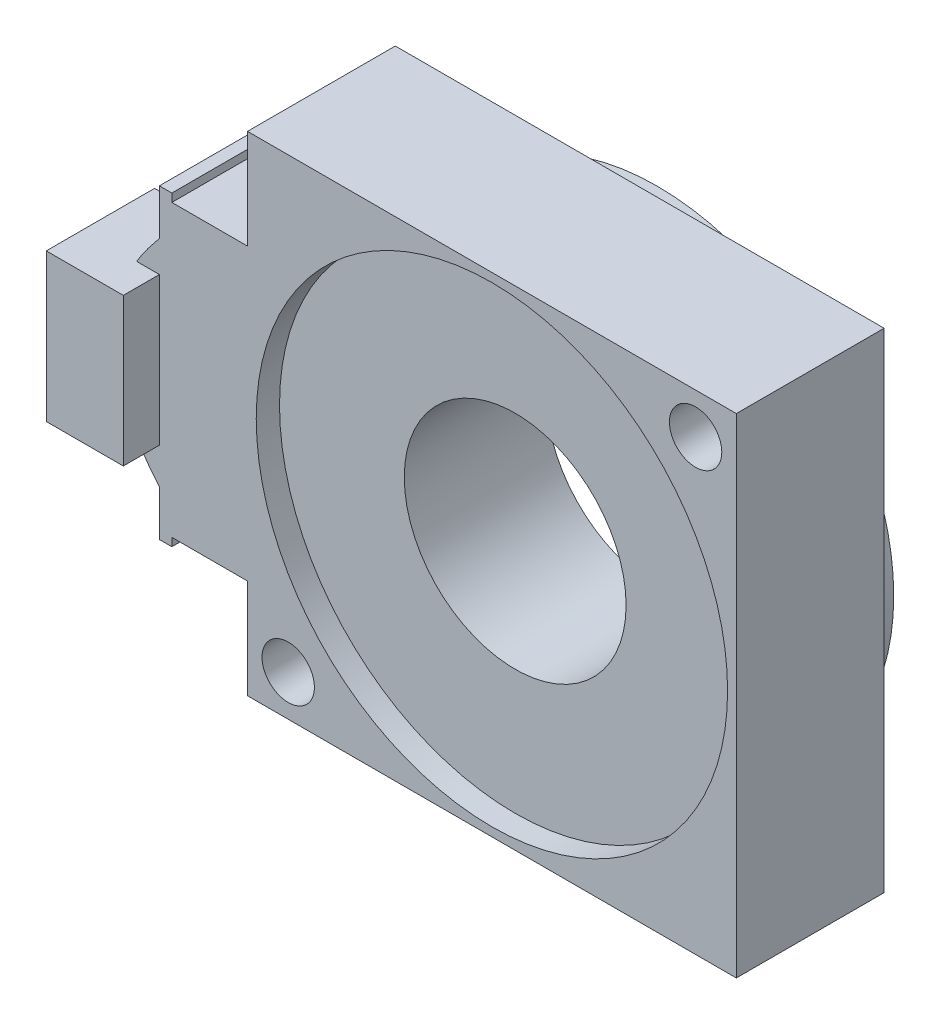
ISO-10303-21;
HEADER;
FILE_DESCRIPTION(('STEP AP214'),'2;1');
FILE_NAME('part.step','',(''),(''),'','','');
FILE_SCHEMA(('AUTOMOTIVE_DESIGN { 1 0 10303 214 1 1 1 1 }'));
ENDSEC;
DATA;
#1=APPLICATION_CONTEXT('core data for automotive mechanical design processes');
#2=APPLICATION_PROTOCOL_DEFINITION('international standard','automotive_design',2000,#1);
#3=PRODUCT_CONTEXT('',#1,'mechanical');
#4=PRODUCT('Part','Part','',(#3));
#5=PRODUCT_RELATED_PRODUCT_CATEGORY('part','',(#4));
#6=PRODUCT_DEFINITION_FORMATION('','',#4);
#7=PRODUCT_DEFINITION_CONTEXT('part definition',#1,'design');
#8=PRODUCT_DEFINITION('design','',#6,#7);
#9=PRODUCT_DEFINITION_SHAPE('','',#8);
#10=(LENGTH_UNIT() NAMED_UNIT(*) SI_UNIT(.MILLI.,.METRE.));
#11=(NAMED_UNIT(*) PLANE_ANGLE_UNIT() SI_UNIT($,.RADIAN.));
#12=(NAMED_UNIT(*) SI_UNIT($,.STERADIAN.) SOLID_ANGLE_UNIT());
#13=UNCERTAINTY_MEASURE_WITH_UNIT(LENGTH_MEASURE(1.E-05),#10,'distance_accuracy_value','');
#14=(GEOMETRIC_REPRESENTATION_CONTEXT(3) GLOBAL_UNCERTAINTY_ASSIGNED_CONTEXT((#13)) GLOBAL_UNIT_ASSIGNED_CONTEXT((#10,
#11,#12)) REPRESENTATION_CONTEXT('',''));
#15=CARTESIAN_POINT('',(0.,0.,0.));
#16=DIRECTION('',(0.,0.,1.));
#17=DIRECTION('',(1.,0.,0.));
#18=AXIS2_PLACEMENT_3D('',#15,#16,#17);
#19=CARTESIAN_POINT('',(0.,0.,12.7));
#20=DIRECTION('',(0.,0.,1.));
#21=DIRECTION('',(1.,0.,0.));
#22=AXIS2_PLACEMENT_3D('',#19,#20,#21);
#23=PLANE('',#22);
#24=CARTESIAN_POINT('',(0.,0.,12.7));
#25=DIRECTION('',(0.,0.,1.));
#26=DIRECTION('',(1.,0.,0.));
#27=AXIS2_PLACEMENT_3D('',#24,#25,#26);
#28=CIRCLE('',#27,20.25);
#29=CARTESIAN_POINT('',(20.25,0.,12.7));
#30=VERTEX_POINT('',#29);
#31=EDGE_CURVE('E226',#30,#30,#28,.T.);
#32=ORIENTED_EDGE('',*,*,#31,.F.);
#33=EDGE_LOOP('',(#32));
#34=FACE_BOUND('',#33,.T.);
#35=CARTESIAN_POINT('',(17.5008928343671,17.5008928343671,12.7));
#36=DIRECTION('',(0.,0.,1.));
#37=DIRECTION('',(1.,0.,0.));
#38=AXIS2_PLACEMENT_3D('',#35,#36,#37);
#39=CIRCLE('',#38,2.25);
#40=CARTESIAN_POINT('',(19.7508928343671,17.5008928343671,12.7));
#41=VERTEX_POINT('',#40);
#42=EDGE_CURVE('E412',#41,#41,#39,.T.);
#43=ORIENTED_EDGE('',*,*,#42,.F.);
#44=EDGE_LOOP('',(#43));
#45=FACE_BOUND('',#44,.T.);
#46=CARTESIAN_POINT('',(-17.5008928343671,-17.5008928343671,12.7));
#47=DIRECTION('',(0.,0.,1.));
#48=DIRECTION('',(-1.,0.,0.));
#49=AXIS2_PLACEMENT_3D('',#46,#47,#48);
#50=CIRCLE('',#49,2.25);
#51=CARTESIAN_POINT('',(-19.7508928343671,-17.5008928343671,12.7));
#52=VERTEX_POINT('',#51);
#53=EDGE_CURVE('E419',#52,#52,#50,.T.);
#54=ORIENTED_EDGE('',*,*,#53,.F.);
#55=EDGE_LOOP('',(#54));
#56=FACE_BOUND('',#55,.T.);
#57=CARTESIAN_POINT('',(-28.57,9.24089283436704,12.7));
#58=CARTESIAN_POINT('',(-36.45,0.,12.7));
#59=CARTESIAN_POINT('',(-28.57,-9.24089283436705,12.7));
#60=B_SPLINE_CURVE_WITH_KNOTS('',2,(#57,#58,#59),.UNSPECIFIED.,.F.,.F.,(3,3),(0.,1.),.UNSPECIFIED.);
#61=CARTESIAN_POINT('',(-28.57,9.24089283436704,12.7));
#62=VERTEX_POINT('',#61);
#63=CARTESIAN_POINT('',(-30.5239314132723,6.56089283436704,12.7));
#64=VERTEX_POINT('',#63);
#65=EDGE_CURVE('E362',#62,#64,#60,.T.);
#66=ORIENTED_EDGE('',*,*,#65,.T.);
#67=DIRECTION('',(1.,0.,0.));
#68=VECTOR('',#67,1.);
#69=CARTESIAN_POINT('',(0.,6.56089283436705,12.7));
#70=LINE('',#69,#68);
#71=CARTESIAN_POINT('',(-28.57,6.56089283436704,12.7));
#72=VERTEX_POINT('',#71);
#73=EDGE_CURVE('E216',#64,#72,#70,.T.);
#74=ORIENTED_EDGE('',*,*,#73,.T.);
#75=DIRECTION('',(0.,-1.,0.));
#76=VECTOR('',#75,1.);
#77=CARTESIAN_POINT('',(-28.57,0.,12.7));
#78=LINE('',#77,#76);
#79=CARTESIAN_POINT('',(-28.57,-6.13910716563296,12.7));
#80=VERTEX_POINT('',#79);
#81=EDGE_CURVE('E11',#72,#80,#78,.T.);
#82=ORIENTED_EDGE('',*,*,#81,.T.);
#83=DIRECTION('',(-1.,0.,0.));
#84=VECTOR('',#83,1.);
#85=CARTESIAN_POINT('',(0.,-6.13910716563296,12.7));
#86=LINE('',#85,#84);
#87=CARTESIAN_POINT('',(-30.7710832797259,-6.13910716563296,12.7));
#88=VERTEX_POINT('',#87);
#89=EDGE_CURVE('E213',#80,#88,#86,.T.);
#90=ORIENTED_EDGE('',*,*,#89,.T.);
#91=CARTESIAN_POINT('',(-28.57,-9.24089283436705,12.7));
#92=VERTEX_POINT('',#91);
#93=EDGE_CURVE('E369',#88,#92,#60,.T.);
#94=ORIENTED_EDGE('',*,*,#93,.T.);
#95=DIRECTION('',(0.,-1.,0.));
#96=VECTOR('',#95,1.);
#97=CARTESIAN_POINT('',(-28.57,-13.1608928343671,12.7));
#98=LINE('',#97,#96);
#99=CARTESIAN_POINT('',(-28.57,-13.1608928343671,12.7));
#100=VERTEX_POINT('',#99);
#101=EDGE_CURVE('E368',#92,#100,#98,.T.);
#102=ORIENTED_EDGE('',*,*,#101,.T.);
#103=DIRECTION('',(1.,0.,0.));
#104=VECTOR('',#103,1.);
#105=CARTESIAN_POINT('',(-27.5,-13.1608928343671,12.7));
#106=LINE('',#105,#104);
#107=CARTESIAN_POINT('',(-27.5,-13.1608928343671,12.7));
#108=VERTEX_POINT('',#107);
#109=EDGE_CURVE('E372',#100,#108,#106,.T.);
#110=ORIENTED_EDGE('',*,*,#109,.T.);
#111=DIRECTION('',(0.,1.,0.));
#112=VECTOR('',#111,1.);
#113=CARTESIAN_POINT('',(-27.5,-12.4608928343671,12.7));
#114=LINE('',#113,#112);
#115=CARTESIAN_POINT('',(-27.5,-12.4608928343671,12.7));
#116=VERTEX_POINT('',#115);
#117=EDGE_CURVE('E384',#108,#116,#114,.T.);
#118=ORIENTED_EDGE('',*,*,#117,.T.);
#119=DIRECTION('',(1.,0.,0.));
#120=VECTOR('',#119,1.);
#121=CARTESIAN_POINT('',(-21.,-12.4608928343671,12.7));
#122=LINE('',#121,#120);
#123=CARTESIAN_POINT('',(-21.,-12.4608928343671,12.7));
#124=VERTEX_POINT('',#123);
#125=EDGE_CURVE('E241',#116,#124,#122,.T.);
#126=ORIENTED_EDGE('',*,*,#125,.T.);
#127=DIRECTION('',(0.,-1.,0.));
#128=VECTOR('',#127,1.);
#129=CARTESIAN_POINT('',(-21.,21.,12.7));
#130=LINE('',#129,#128);
#131=CARTESIAN_POINT('',(-21.,-21.,12.7));
#132=VERTEX_POINT('',#131);
#133=EDGE_CURVE('E426',#124,#132,#130,.T.);
#134=ORIENTED_EDGE('',*,*,#133,.T.);
#135=DIRECTION('',(1.,0.,0.));
#136=VECTOR('',#135,1.);
#137=CARTESIAN_POINT('',(21.,-21.,12.7));
#138=LINE('',#137,#136);
#139=CARTESIAN_POINT('',(21.,-21.,12.7));
#140=VERTEX_POINT('',#139);
#141=EDGE_CURVE('E430',#132,#140,#138,.T.);
#142=ORIENTED_EDGE('',*,*,#141,.T.);
#143=DIRECTION('',(0.,1.,0.));
#144=VECTOR('',#143,1.);
#145=CARTESIAN_POINT('',(21.,21.,12.7));
#146=LINE('',#145,#144);
#147=CARTESIAN_POINT('',(21.,21.,12.7));
#148=VERTEX_POINT('',#147);
#149=EDGE_CURVE('E335',#140,#148,#146,.T.);
#150=ORIENTED_EDGE('',*,*,#149,.T.);
#151=DIRECTION('',(-1.,0.,0.));
#152=VECTOR('',#151,1.);
#153=CARTESIAN_POINT('',(0.,21.,12.7));
#154=LINE('',#153,#152);
#155=CARTESIAN_POINT('',(-21.,21.,12.7));
#156=VERTEX_POINT('',#155);
#157=EDGE_CURVE('E342',#148,#156,#154,.T.);
#158=ORIENTED_EDGE('',*,*,#157,.T.);
#159=CARTESIAN_POINT('',(-21.,12.4608928343671,12.7));
#160=VERTEX_POINT('',#159);
#161=EDGE_CURVE('E427',#156,#160,#130,.T.);
#162=ORIENTED_EDGE('',*,*,#161,.T.);
#163=DIRECTION('',(-1.,0.,0.));
#164=VECTOR('',#163,1.);
#165=CARTESIAN_POINT('',(-21.,12.460892834367,12.7));
#166=LINE('',#165,#164);
#167=CARTESIAN_POINT('',(-27.5,12.460892834367,12.7));
#168=VERTEX_POINT('',#167);
#169=EDGE_CURVE('E63',#160,#168,#166,.T.);
#170=ORIENTED_EDGE('',*,*,#169,.T.);
#171=DIRECTION('',(0.,1.,0.));
#172=VECTOR('',#171,1.);
#173=CARTESIAN_POINT('',(-27.5,12.460892834367,12.7));
#174=LINE('',#173,#172);
#175=CARTESIAN_POINT('',(-27.5,13.160892834367,12.7));
#176=VERTEX_POINT('',#175);
#177=EDGE_CURVE('E448',#168,#176,#174,.T.);
#178=ORIENTED_EDGE('',*,*,#177,.T.);
#179=DIRECTION('',(-1.,0.,0.));
#180=VECTOR('',#179,1.);
#181=CARTESIAN_POINT('',(-27.5,13.160892834367,12.7));
#182=LINE('',#181,#180);
#183=CARTESIAN_POINT('',(-28.57,13.160892834367,12.7));
#184=VERTEX_POINT('',#183);
#185=EDGE_CURVE('E450',#176,#184,#182,.T.);
#186=ORIENTED_EDGE('',*,*,#185,.T.);
#187=DIRECTION('',(0.,-1.,0.));
#188=VECTOR('',#187,1.);
#189=CARTESIAN_POINT('',(-28.57,13.160892834367,12.7));
#190=LINE('',#189,#188);
#191=EDGE_CURVE('E367',#184,#62,#190,.T.);
#192=ORIENTED_EDGE('',*,*,#191,.T.);
#193=EDGE_LOOP('',(#66,#74,#82,#90,#94,#102,#110,#118,#126,#134,#142,#150,#158,#162,#170,#178,
#186,#192));
#194=FACE_BOUND('',#193,.T.);
#195=ADVANCED_FACE('F40',(#34,#45,#56,#194),#23,.T.);
#196=CARTESIAN_POINT('',(-28.57,9.24089283436704,0.));
#197=CARTESIAN_POINT('',(-36.45,0.,0.));
#198=CARTESIAN_POINT('',(-28.57,-9.24089283436705,0.));
#199=B_SPLINE_CURVE_WITH_KNOTS('',2,(#196,#197,#198),.UNSPECIFIED.,.F.,.F.,(3,3),(0.,1.),.UNSPECIFIED.);
#200=DIRECTION('',(0.,0.,1.));
#201=VECTOR('',#200,1.);
#202=SURFACE_OF_LINEAR_EXTRUSION('',#199,#201);
#203=CARTESIAN_POINT('',(-28.57,9.24089283436704,6.5));
#204=CARTESIAN_POINT('',(-36.45,0.,6.5));
#205=CARTESIAN_POINT('',(-28.57,-9.24089283436705,6.5));
#206=B_SPLINE_CURVE_WITH_KNOTS('',2,(#203,#204,#205),.UNSPECIFIED.,.F.,.F.,(3,3),(0.,1.),.UNSPECIFIED.);
#207=CARTESIAN_POINT('',(-30.7710832797259,-6.13910716563296,6.5));
#208=VERTEX_POINT('',#207);
#209=CARTESIAN_POINT('',(-30.5239314132723,6.56089283436704,6.5));
#210=VERTEX_POINT('',#209);
#211=EDGE_CURVE('E230',#208,#210,#206,.F.);
#212=ORIENTED_EDGE('',*,*,#211,.T.);
#213=DIRECTION('',(0.,0.,1.));
#214=VECTOR('',#213,1.);
#215=CARTESIAN_POINT('',(-30.5239314132723,6.56089283436704,0.));
#216=LINE('',#215,#214);
#217=EDGE_CURVE('E48',#210,#64,#216,.T.);
#218=ORIENTED_EDGE('',*,*,#217,.T.);
#219=ORIENTED_EDGE('',*,*,#65,.F.);
#220=DIRECTION('',(0.,0.,1.));
#221=VECTOR('',#220,1.);
#222=CARTESIAN_POINT('',(-28.57,9.24089283436704,0.));
#223=LINE('',#222,#221);
#224=CARTESIAN_POINT('',(-28.57,9.24089283436704,0.));
#225=VERTEX_POINT('',#224);
#226=EDGE_CURVE('E401',#225,#62,#223,.T.);
#227=ORIENTED_EDGE('',*,*,#226,.F.);
#228=CARTESIAN_POINT('',(-28.57,-9.24089283436705,0.));
#229=VERTEX_POINT('',#228);
#230=EDGE_CURVE('E250',#225,#229,#199,.T.);
#231=ORIENTED_EDGE('',*,*,#230,.T.);
#232=DIRECTION('',(0.,0.,1.));
#233=VECTOR('',#232,1.);
#234=CARTESIAN_POINT('',(-28.57,-9.24089283436705,0.));
#235=LINE('',#234,#233);
#236=EDGE_CURVE('E398',#229,#92,#235,.T.);
#237=ORIENTED_EDGE('',*,*,#236,.T.);
#238=ORIENTED_EDGE('',*,*,#93,.F.);
#239=DIRECTION('',(0.,0.,1.));
#240=VECTOR('',#239,1.);
#241=CARTESIAN_POINT('',(-30.7710832797259,-6.13910716563296,0.));
#242=LINE('',#241,#240);
#243=EDGE_CURVE('E355',#88,#208,#242,.F.);
#244=ORIENTED_EDGE('',*,*,#243,.T.);
#245=EDGE_LOOP('',(#212,#218,#219,#227,#231,#237,#238,#244));
#246=FACE_BOUND('',#245,.T.);
#247=ADVANCED_FACE('F262',(#246),#202,.T.);
#248=CARTESIAN_POINT('',(-21.,21.,12.7));
#249=DIRECTION('',(1.,0.,0.));
#250=DIRECTION('',(0.,0.,-1.));
#251=AXIS2_PLACEMENT_3D('',#248,#249,#250);
#252=PLANE('',#251);
#253=DIRECTION('',(0.,0.,1.));
#254=VECTOR('',#253,1.);
#255=CARTESIAN_POINT('',(-21.,-12.4608928343671,0.));
#256=LINE('',#255,#254);
#257=CARTESIAN_POINT('',(-21.,-12.4608928343671,0.));
#258=VERTEX_POINT('',#257);
#259=EDGE_CURVE('E389',#258,#124,#256,.T.);
#260=ORIENTED_EDGE('',*,*,#259,.F.);
#261=DIRECTION('',(0.,-1.,0.));
#262=VECTOR('',#261,1.);
#263=CARTESIAN_POINT('',(-21.,21.,0.));
#264=LINE('',#263,#262);
#265=CARTESIAN_POINT('',(-21.,-21.,0.));
#266=VERTEX_POINT('',#265);
#267=EDGE_CURVE('E415',#258,#266,#264,.T.);
#268=ORIENTED_EDGE('',*,*,#267,.T.);
#269=DIRECTION('',(0.,0.,-1.));
#270=VECTOR('',#269,1.);
#271=CARTESIAN_POINT('',(-21.,-21.,12.7));
#272=LINE('',#271,#270);
#273=EDGE_CURVE('E325',#132,#266,#272,.T.);
#274=ORIENTED_EDGE('',*,*,#273,.F.);
#275=ORIENTED_EDGE('',*,*,#133,.F.);
#276=EDGE_LOOP('',(#260,#268,#274,#275));
#277=FACE_BOUND('',#276,.T.);
#278=ADVANCED_FACE('F266',(#277),#252,.F.);
#279=CARTESIAN_POINT('',(-21.,21.,0.));
#280=VERTEX_POINT('',#279);
#281=CARTESIAN_POINT('',(-21.,12.460892834367,0.));
#282=VERTEX_POINT('',#281);
#283=EDGE_CURVE('E330',#280,#282,#264,.T.);
#284=ORIENTED_EDGE('',*,*,#283,.T.);
#285=DIRECTION('',(0.,0.,1.));
#286=VECTOR('',#285,1.);
#287=CARTESIAN_POINT('',(-21.,12.460892834367,0.));
#288=LINE('',#287,#286);
#289=EDGE_CURVE('E409',#282,#160,#288,.T.);
#290=ORIENTED_EDGE('',*,*,#289,.T.);
#291=ORIENTED_EDGE('',*,*,#161,.F.);
#292=DIRECTION('',(0.,0.,-1.));
#293=VECTOR('',#292,1.);
#294=CARTESIAN_POINT('',(-21.,21.,12.7));
#295=LINE('',#294,#293);
#296=EDGE_CURVE('E231',#156,#280,#295,.T.);
#297=ORIENTED_EDGE('',*,*,#296,.T.);
#298=EDGE_LOOP('',(#284,#290,#291,#297));
#299=FACE_BOUND('',#298,.T.);
#300=ADVANCED_FACE('F42',(#299),#252,.F.);
#301=CARTESIAN_POINT('',(21.,-21.,12.7));
#302=DIRECTION('',(0.,1.,0.));
#303=DIRECTION('',(0.,0.,1.));
#304=AXIS2_PLACEMENT_3D('',#301,#302,#303);
#305=PLANE('',#304);
#306=DIRECTION('',(1.,0.,0.));
#307=VECTOR('',#306,1.);
#308=CARTESIAN_POINT('',(21.,-21.,0.));
#309=LINE('',#308,#307);
#310=CARTESIAN_POINT('',(21.,-21.,0.));
#311=VERTEX_POINT('',#310);
#312=EDGE_CURVE('E319',#266,#311,#309,.T.);
#313=ORIENTED_EDGE('',*,*,#312,.T.);
#314=DIRECTION('',(0.,0.,-1.));
#315=VECTOR('',#314,1.);
#316=CARTESIAN_POINT('',(21.,-21.,12.7));
#317=LINE('',#316,#315);
#318=EDGE_CURVE('E322',#140,#311,#317,.T.);
#319=ORIENTED_EDGE('',*,*,#318,.F.);
#320=ORIENTED_EDGE('',*,*,#141,.F.);
#321=ORIENTED_EDGE('',*,*,#273,.T.);
#322=EDGE_LOOP('',(#313,#319,#320,#321));
#323=FACE_BOUND('',#322,.T.);
#324=ADVANCED_FACE('F308',(#323),#305,.F.);
#325=CARTESIAN_POINT('',(21.,21.,12.7));
#326=DIRECTION('',(-1.,0.,0.));
#327=DIRECTION('',(0.,0.,1.));
#328=AXIS2_PLACEMENT_3D('',#325,#326,#327);
#329=PLANE('',#328);
#330=DIRECTION('',(0.,1.,0.));
#331=VECTOR('',#330,1.);
#332=CARTESIAN_POINT('',(21.,21.,0.));
#333=LINE('',#332,#331);
#334=CARTESIAN_POINT('',(21.,21.,0.));
#335=VERTEX_POINT('',#334);
#336=EDGE_CURVE('E329',#311,#335,#333,.T.);
#337=ORIENTED_EDGE('',*,*,#336,.T.);
#338=DIRECTION('',(0.,0.,-1.));
#339=VECTOR('',#338,1.);
#340=CARTESIAN_POINT('',(21.,21.,12.7));
#341=LINE('',#340,#339);
#342=EDGE_CURVE('E336',#148,#335,#341,.T.);
#343=ORIENTED_EDGE('',*,*,#342,.F.);
#344=ORIENTED_EDGE('',*,*,#149,.F.);
#345=ORIENTED_EDGE('',*,*,#318,.T.);
#346=EDGE_LOOP('',(#337,#343,#344,#345));
#347=FACE_BOUND('',#346,.T.);
#348=ADVANCED_FACE('F305',(#347),#329,.F.);
#349=CARTESIAN_POINT('',(0.,21.,12.7));
#350=DIRECTION('',(0.,-1.,0.));
#351=DIRECTION('',(0.,0.,-1.));
#352=AXIS2_PLACEMENT_3D('',#349,#350,#351);
#353=PLANE('',#352);
#354=DIRECTION('',(-1.,0.,0.));
#355=VECTOR('',#354,1.);
#356=CARTESIAN_POINT('',(0.,21.,0.));
#357=LINE('',#356,#355);
#358=EDGE_CURVE('E340',#335,#280,#357,.T.);
#359=ORIENTED_EDGE('',*,*,#358,.T.);
#360=ORIENTED_EDGE('',*,*,#296,.F.);
#361=ORIENTED_EDGE('',*,*,#157,.F.);
#362=ORIENTED_EDGE('',*,*,#342,.T.);
#363=EDGE_LOOP('',(#359,#360,#361,#362));
#364=FACE_BOUND('',#363,.T.);
#365=ADVANCED_FACE('F301',(#364),#353,.F.);
#366=CARTESIAN_POINT('',(0.,0.,0.));
#367=DIRECTION('',(0.,0.,1.));
#368=DIRECTION('',(1.,0.,0.));
#369=AXIS2_PLACEMENT_3D('',#366,#367,#368);
#370=PLANE('',#369);
#371=CARTESIAN_POINT('',(0.,0.,0.));
#372=DIRECTION('',(0.,0.,-1.));
#373=DIRECTION('',(-1.,0.,0.));
#374=AXIS2_PLACEMENT_3D('',#371,#372,#373);
#375=CIRCLE('',#374,20.325);
#376=CARTESIAN_POINT('',(-20.325,0.,0.));
#377=VERTEX_POINT('',#376);
#378=EDGE_CURVE('E227',#377,#377,#375,.T.);
#379=ORIENTED_EDGE('',*,*,#378,.F.);
#380=EDGE_LOOP('',(#379));
#381=FACE_BOUND('',#380,.T.);
#382=CARTESIAN_POINT('',(17.5008928343671,17.5008928343671,0.));
#383=DIRECTION('',(0.,0.,1.));
#384=DIRECTION('',(1.,0.,0.));
#385=AXIS2_PLACEMENT_3D('',#382,#383,#384);
#386=CIRCLE('',#385,2.25);
#387=CARTESIAN_POINT('',(19.7508928343671,17.5008928343671,0.));
#388=VERTEX_POINT('',#387);
#389=EDGE_CURVE('E416',#388,#388,#386,.T.);
#390=ORIENTED_EDGE('',*,*,#389,.T.);
#391=EDGE_LOOP('',(#390));
#392=FACE_BOUND('',#391,.T.);
#393=CARTESIAN_POINT('',(-17.5008928343671,-17.5008928343671,0.));
#394=DIRECTION('',(0.,0.,1.));
#395=DIRECTION('',(-1.,0.,0.));
#396=AXIS2_PLACEMENT_3D('',#393,#394,#395);
#397=CIRCLE('',#396,2.25);
#398=CARTESIAN_POINT('',(-19.7508928343671,-17.5008928343671,0.));
#399=VERTEX_POINT('',#398);
#400=EDGE_CURVE('E391',#399,#399,#397,.T.);
#401=ORIENTED_EDGE('',*,*,#400,.T.);
#402=EDGE_LOOP('',(#401));
#403=FACE_BOUND('',#402,.T.);
#404=ORIENTED_EDGE('',*,*,#283,.F.);
#405=ORIENTED_EDGE('',*,*,#358,.F.);
#406=ORIENTED_EDGE('',*,*,#336,.F.);
#407=ORIENTED_EDGE('',*,*,#312,.F.);
#408=ORIENTED_EDGE('',*,*,#267,.F.);
#409=DIRECTION('',(1.,0.,0.));
#410=VECTOR('',#409,1.);
#411=CARTESIAN_POINT('',(-21.,-12.4608928343671,0.));
#412=LINE('',#411,#410);
#413=CARTESIAN_POINT('',(-27.5,-12.4608928343671,0.));
#414=VERTEX_POINT('',#413);
#415=EDGE_CURVE('E411',#414,#258,#412,.T.);
#416=ORIENTED_EDGE('',*,*,#415,.F.);
#417=DIRECTION('',(0.,1.,0.));
#418=VECTOR('',#417,1.);
#419=CARTESIAN_POINT('',(-27.5,-12.4608928343671,0.));
#420=LINE('',#419,#418);
#421=CARTESIAN_POINT('',(-27.5,-13.1608928343671,0.));
#422=VERTEX_POINT('',#421);
#423=EDGE_CURVE('E440',#422,#414,#420,.T.);
#424=ORIENTED_EDGE('',*,*,#423,.F.);
#425=DIRECTION('',(1.,0.,0.));
#426=VECTOR('',#425,1.);
#427=CARTESIAN_POINT('',(-27.5,-13.1608928343671,0.));
#428=LINE('',#427,#426);
#429=CARTESIAN_POINT('',(-28.57,-13.1608928343671,0.));
#430=VERTEX_POINT('',#429);
#431=EDGE_CURVE('E444',#430,#422,#428,.T.);
#432=ORIENTED_EDGE('',*,*,#431,.F.);
#433=DIRECTION('',(0.,-1.,0.));
#434=VECTOR('',#433,1.);
#435=CARTESIAN_POINT('',(-28.57,-13.1608928343671,0.));
#436=LINE('',#435,#434);
#437=EDGE_CURVE('E256',#229,#430,#436,.T.);
#438=ORIENTED_EDGE('',*,*,#437,.F.);
#439=ORIENTED_EDGE('',*,*,#230,.F.);
#440=DIRECTION('',(0.,-1.,0.));
#441=VECTOR('',#440,1.);
#442=CARTESIAN_POINT('',(-28.57,13.160892834367,0.));
#443=LINE('',#442,#441);
#444=CARTESIAN_POINT('',(-28.57,13.160892834367,0.));
#445=VERTEX_POINT('',#444);
#446=EDGE_CURVE('E247',#445,#225,#443,.T.);
#447=ORIENTED_EDGE('',*,*,#446,.F.);
#448=DIRECTION('',(-1.,0.,0.));
#449=VECTOR('',#448,1.);
#450=CARTESIAN_POINT('',(-27.5,13.160892834367,0.));
#451=LINE('',#450,#449);
#452=CARTESIAN_POINT('',(-27.5,13.160892834367,0.));
#453=VERTEX_POINT('',#452);
#454=EDGE_CURVE('E244',#453,#445,#451,.T.);
#455=ORIENTED_EDGE('',*,*,#454,.F.);
#456=DIRECTION('',(0.,1.,0.));
#457=VECTOR('',#456,1.);
#458=CARTESIAN_POINT('',(-27.5,12.460892834367,0.));
#459=LINE('',#458,#457);
#460=CARTESIAN_POINT('',(-27.5,12.460892834367,0.));
#461=VERTEX_POINT('',#460);
#462=EDGE_CURVE('E240',#461,#453,#459,.T.);
#463=ORIENTED_EDGE('',*,*,#462,.F.);
#464=DIRECTION('',(-1.,0.,0.));
#465=VECTOR('',#464,1.);
#466=CARTESIAN_POINT('',(-21.,12.460892834367,0.));
#467=LINE('',#466,#465);
#468=EDGE_CURVE('E237',#282,#461,#467,.T.);
#469=ORIENTED_EDGE('',*,*,#468,.F.);
#470=EDGE_LOOP('',(#404,#405,#406,#407,#408,#416,#424,#432,#438,#439,#447,#455,#463,#469));
#471=FACE_BOUND('',#470,.T.);
#472=ADVANCED_FACE('F294',(#381,#392,#403,#471),#370,.F.);
#473=CARTESIAN_POINT('',(-17.5008928343671,-17.5008928343671,12.7));
#474=DIRECTION('',(0.,0.,-1.));
#475=DIRECTION('',(-1.,0.,0.));
#476=AXIS2_PLACEMENT_3D('',#473,#474,#475);
#477=CYLINDRICAL_SURFACE('',#476,2.25);
#478=ORIENTED_EDGE('',*,*,#53,.T.);
#479=EDGE_LOOP('',(#478));
#480=FACE_BOUND('',#479,.T.);
#481=ORIENTED_EDGE('',*,*,#400,.F.);
#482=EDGE_LOOP('',(#481));
#483=FACE_BOUND('',#482,.T.);
#484=ADVANCED_FACE('F290',(#480,#483),#477,.F.);
#485=CARTESIAN_POINT('',(17.5008928343671,17.5008928343671,12.7));
#486=DIRECTION('',(0.,0.,-1.));
#487=DIRECTION('',(-1.,0.,0.));
#488=AXIS2_PLACEMENT_3D('',#485,#486,#487);
#489=CYLINDRICAL_SURFACE('',#488,2.25);
#490=ORIENTED_EDGE('',*,*,#42,.T.);
#491=EDGE_LOOP('',(#490));
#492=FACE_BOUND('',#491,.T.);
#493=ORIENTED_EDGE('',*,*,#389,.F.);
#494=EDGE_LOOP('',(#493));
#495=FACE_BOUND('',#494,.T.);
#496=ADVANCED_FACE('F286',(#492,#495),#489,.F.);
#497=CARTESIAN_POINT('',(-21.,-12.4608928343671,0.));
#498=DIRECTION('',(0.,-1.,0.));
#499=DIRECTION('',(1.,0.,0.));
#500=AXIS2_PLACEMENT_3D('',#497,#498,#499);
#501=PLANE('',#500);
#502=ORIENTED_EDGE('',*,*,#125,.F.);
#503=DIRECTION('',(0.,0.,1.));
#504=VECTOR('',#503,1.);
#505=CARTESIAN_POINT('',(-27.5,-12.4608928343671,0.));
#506=LINE('',#505,#504);
#507=EDGE_CURVE('E392',#414,#116,#506,.T.);
#508=ORIENTED_EDGE('',*,*,#507,.F.);
#509=ORIENTED_EDGE('',*,*,#415,.T.);
#510=ORIENTED_EDGE('',*,*,#259,.T.);
#511=EDGE_LOOP('',(#502,#508,#509,#510));
#512=FACE_BOUND('',#511,.T.);
#513=ADVANCED_FACE('F289',(#512),#501,.T.);
#514=CARTESIAN_POINT('',(-27.5,-12.4608928343671,0.));
#515=DIRECTION('',(1.,0.,0.));
#516=DIRECTION('',(0.,0.,-1.));
#517=AXIS2_PLACEMENT_3D('',#514,#515,#516);
#518=PLANE('',#517);
#519=ORIENTED_EDGE('',*,*,#117,.F.);
#520=DIRECTION('',(0.,0.,1.));
#521=VECTOR('',#520,1.);
#522=CARTESIAN_POINT('',(-27.5,-13.1608928343671,0.));
#523=LINE('',#522,#521);
#524=EDGE_CURVE('E394',#422,#108,#523,.T.);
#525=ORIENTED_EDGE('',*,*,#524,.F.);
#526=ORIENTED_EDGE('',*,*,#423,.T.);
#527=ORIENTED_EDGE('',*,*,#507,.T.);
#528=EDGE_LOOP('',(#519,#525,#526,#527));
#529=FACE_BOUND('',#528,.T.);
#530=ADVANCED_FACE('F504',(#529),#518,.T.);
#531=CARTESIAN_POINT('',(-27.5,-13.1608928343671,0.));
#532=DIRECTION('',(0.,-1.,0.));
#533=DIRECTION('',(0.,0.,-1.));
#534=AXIS2_PLACEMENT_3D('',#531,#532,#533);
#535=PLANE('',#534);
#536=ORIENTED_EDGE('',*,*,#109,.F.);
#537=DIRECTION('',(0.,0.,1.));
#538=VECTOR('',#537,1.);
#539=CARTESIAN_POINT('',(-28.57,-13.1608928343671,0.));
#540=LINE('',#539,#538);
#541=EDGE_CURVE('E396',#430,#100,#540,.T.);
#542=ORIENTED_EDGE('',*,*,#541,.F.);
#543=ORIENTED_EDGE('',*,*,#431,.T.);
#544=ORIENTED_EDGE('',*,*,#524,.T.);
#545=EDGE_LOOP('',(#536,#542,#543,#544));
#546=FACE_BOUND('',#545,.T.);
#547=ADVANCED_FACE('F461',(#546),#535,.T.);
#548=CARTESIAN_POINT('',(-28.57,-13.1608928343671,0.));
#549=DIRECTION('',(-1.,0.,0.));
#550=DIRECTION('',(0.,0.,1.));
#551=AXIS2_PLACEMENT_3D('',#548,#549,#550);
#552=PLANE('',#551);
#553=ORIENTED_EDGE('',*,*,#101,.F.);
#554=ORIENTED_EDGE('',*,*,#236,.F.);
#555=ORIENTED_EDGE('',*,*,#437,.T.);
#556=ORIENTED_EDGE('',*,*,#541,.T.);
#557=EDGE_LOOP('',(#553,#554,#555,#556));
#558=FACE_BOUND('',#557,.T.);
#559=ADVANCED_FACE('F268',(#558),#552,.T.);
#560=CARTESIAN_POINT('',(-28.57,13.160892834367,0.));
#561=DIRECTION('',(-1.,0.,0.));
#562=DIRECTION('',(0.,0.,1.));
#563=AXIS2_PLACEMENT_3D('',#560,#561,#562);
#564=PLANE('',#563);
#565=ORIENTED_EDGE('',*,*,#191,.F.);
#566=DIRECTION('',(0.,0.,1.));
#567=VECTOR('',#566,1.);
#568=CARTESIAN_POINT('',(-28.57,13.160892834367,0.));
#569=LINE('',#568,#567);
#570=EDGE_CURVE('E403',#445,#184,#569,.T.);
#571=ORIENTED_EDGE('',*,*,#570,.F.);
#572=ORIENTED_EDGE('',*,*,#446,.T.);
#573=ORIENTED_EDGE('',*,*,#226,.T.);
#574=EDGE_LOOP('',(#565,#571,#572,#573));
#575=FACE_BOUND('',#574,.T.);
#576=ADVANCED_FACE('F270',(#575),#564,.T.);
#577=CARTESIAN_POINT('',(-27.5,13.160892834367,0.));
#578=DIRECTION('',(0.,1.,0.));
#579=DIRECTION('',(0.,0.,1.));
#580=AXIS2_PLACEMENT_3D('',#577,#578,#579);
#581=PLANE('',#580);
#582=ORIENTED_EDGE('',*,*,#185,.F.);
#583=DIRECTION('',(0.,0.,1.));
#584=VECTOR('',#583,1.);
#585=CARTESIAN_POINT('',(-27.5,13.160892834367,0.));
#586=LINE('',#585,#584);
#587=EDGE_CURVE('E405',#453,#176,#586,.T.);
#588=ORIENTED_EDGE('',*,*,#587,.F.);
#589=ORIENTED_EDGE('',*,*,#454,.T.);
#590=ORIENTED_EDGE('',*,*,#570,.T.);
#591=EDGE_LOOP('',(#582,#588,#589,#590));
#592=FACE_BOUND('',#591,.T.);
#593=ADVANCED_FACE('F273',(#592),#581,.T.);
#594=CARTESIAN_POINT('',(-27.5,12.460892834367,0.));
#595=DIRECTION('',(1.,0.,0.));
#596=DIRECTION('',(0.,0.,-1.));
#597=AXIS2_PLACEMENT_3D('',#594,#595,#596);
#598=PLANE('',#597);
#599=ORIENTED_EDGE('',*,*,#177,.F.);
#600=DIRECTION('',(0.,0.,1.));
#601=VECTOR('',#600,1.);
#602=CARTESIAN_POINT('',(-27.5,12.460892834367,0.));
#603=LINE('',#602,#601);
#604=EDGE_CURVE('E407',#461,#168,#603,.T.);
#605=ORIENTED_EDGE('',*,*,#604,.F.);
#606=ORIENTED_EDGE('',*,*,#462,.T.);
#607=ORIENTED_EDGE('',*,*,#587,.T.);
#608=EDGE_LOOP('',(#599,#605,#606,#607));
#609=FACE_BOUND('',#608,.T.);
#610=ADVANCED_FACE('F277',(#609),#598,.T.);
#611=CARTESIAN_POINT('',(-21.,12.460892834367,0.));
#612=DIRECTION('',(0.,1.,0.));
#613=DIRECTION('',(-1.,0.,0.));
#614=AXIS2_PLACEMENT_3D('',#611,#612,#613);
#615=PLANE('',#614);
#616=ORIENTED_EDGE('',*,*,#169,.F.);
#617=ORIENTED_EDGE('',*,*,#289,.F.);
#618=ORIENTED_EDGE('',*,*,#468,.T.);
#619=ORIENTED_EDGE('',*,*,#604,.T.);
#620=EDGE_LOOP('',(#616,#617,#618,#619));
#621=FACE_BOUND('',#620,.T.);
#622=ADVANCED_FACE('F281',(#621),#615,.T.);
#623=CARTESIAN_POINT('',(0.,0.,10.7));
#624=DIRECTION('',(0.,0.,1.));
#625=DIRECTION('',(1.,0.,0.));
#626=AXIS2_PLACEMENT_3D('',#623,#624,#625);
#627=CYLINDRICAL_SURFACE('',#626,20.25);
#628=CARTESIAN_POINT('',(0.,0.,10.7));
#629=DIRECTION('',(0.,0.,1.));
#630=DIRECTION('',(1.,0.,0.));
#631=AXIS2_PLACEMENT_3D('',#628,#629,#630);
#632=CIRCLE('',#631,20.25);
#633=CARTESIAN_POINT('',(20.25,0.,10.7));
#634=VERTEX_POINT('',#633);
#635=EDGE_CURVE('E232',#634,#634,#632,.T.);
#636=ORIENTED_EDGE('',*,*,#635,.F.);
#637=EDGE_LOOP('',(#636));
#638=FACE_BOUND('',#637,.T.);
#639=ORIENTED_EDGE('',*,*,#31,.T.);
#640=EDGE_LOOP('',(#639));
#641=FACE_BOUND('',#640,.T.);
#642=ADVANCED_FACE('F285',(#638,#641),#627,.F.);
#643=CARTESIAN_POINT('',(0.,0.,10.7));
#644=DIRECTION('',(0.,0.,1.));
#645=DIRECTION('',(1.,0.,0.));
#646=AXIS2_PLACEMENT_3D('',#643,#644,#645);
#647=PLANE('',#646);
#648=CARTESIAN_POINT('',(0.,0.,10.7));
#649=DIRECTION('',(0.,0.,1.));
#650=DIRECTION('',(1.,0.,0.));
#651=AXIS2_PLACEMENT_3D('',#648,#649,#650);
#652=CIRCLE('',#651,9.53);
#653=CARTESIAN_POINT('',(9.53,0.,10.7));
#654=VERTEX_POINT('',#653);
#655=EDGE_CURVE('E219',#654,#654,#652,.T.);
#656=ORIENTED_EDGE('',*,*,#655,.F.);
#657=EDGE_LOOP('',(#656));
#658=FACE_BOUND('',#657,.T.);
#659=ORIENTED_EDGE('',*,*,#635,.T.);
#660=EDGE_LOOP('',(#659));
#661=FACE_BOUND('',#660,.T.);
#662=ADVANCED_FACE('F494',(#658,#661),#647,.T.);
#663=CARTESIAN_POINT('',(0.,0.,-1.5));
#664=DIRECTION('',(0.,0.,1.));
#665=DIRECTION('',(1.,0.,0.));
#666=AXIS2_PLACEMENT_3D('',#663,#664,#665);
#667=CYLINDRICAL_SURFACE('',#666,20.325);
#668=CARTESIAN_POINT('',(0.,0.,-1.5));
#669=DIRECTION('',(0.,0.,-1.));
#670=DIRECTION('',(-1.,0.,0.));
#671=AXIS2_PLACEMENT_3D('',#668,#669,#670);
#672=CIRCLE('',#671,20.325);
#673=CARTESIAN_POINT('',(-20.325,0.,-1.5));
#674=VERTEX_POINT('',#673);
#675=EDGE_CURVE('E223',#674,#674,#672,.T.);
#676=ORIENTED_EDGE('',*,*,#675,.F.);
#677=EDGE_LOOP('',(#676));
#678=FACE_BOUND('',#677,.T.);
#679=ORIENTED_EDGE('',*,*,#378,.T.);
#680=EDGE_LOOP('',(#679));
#681=FACE_BOUND('',#680,.T.);
#682=ADVANCED_FACE('F490',(#678,#681),#667,.T.);
#683=CARTESIAN_POINT('',(0.,0.,-1.5));
#684=DIRECTION('',(0.,0.,-1.));
#685=DIRECTION('',(-1.,0.,0.));
#686=AXIS2_PLACEMENT_3D('',#683,#684,#685);
#687=PLANE('',#686);
#688=CARTESIAN_POINT('',(0.,0.,-1.5));
#689=DIRECTION('',(0.,0.,-1.));
#690=DIRECTION('',(-1.,0.,0.));
#691=AXIS2_PLACEMENT_3D('',#688,#689,#690);
#692=CIRCLE('',#691,9.53);
#693=CARTESIAN_POINT('',(-9.53,0.,-1.5));
#694=VERTEX_POINT('',#693);
#695=EDGE_CURVE('E222',#694,#694,#692,.T.);
#696=ORIENTED_EDGE('',*,*,#695,.F.);
#697=EDGE_LOOP('',(#696));
#698=FACE_BOUND('',#697,.T.);
#699=ORIENTED_EDGE('',*,*,#675,.T.);
#700=EDGE_LOOP('',(#699));
#701=FACE_BOUND('',#700,.T.);
#702=ADVANCED_FACE('F483',(#698,#701),#687,.T.);
#703=CARTESIAN_POINT('',(0.,0.,-19.3));
#704=DIRECTION('',(0.,0.,1.));
#705=DIRECTION('',(1.,0.,0.));
#706=AXIS2_PLACEMENT_3D('',#703,#704,#705);
#707=CYLINDRICAL_SURFACE('',#706,9.53);
#708=ORIENTED_EDGE('',*,*,#695,.T.);
#709=EDGE_LOOP('',(#708));
#710=FACE_BOUND('',#709,.T.);
#711=ORIENTED_EDGE('',*,*,#655,.T.);
#712=EDGE_LOOP('',(#711));
#713=FACE_BOUND('',#712,.T.);
#714=ADVANCED_FACE('F476',(#710,#713),#707,.F.);
#715=CARTESIAN_POINT('',(-28.57,-6.13910716563296,15.8));
#716=DIRECTION('',(-1.,0.,0.));
#717=DIRECTION('',(0.,0.,1.));
#718=AXIS2_PLACEMENT_3D('',#715,#716,#717);
#719=PLANE('',#718);
#720=ORIENTED_EDGE('',*,*,#81,.F.);
#721=DIRECTION('',(0.,0.,-1.));
#722=VECTOR('',#721,1.);
#723=CARTESIAN_POINT('',(-28.57,6.56089283436704,15.8));
#724=LINE('',#723,#722);
#725=CARTESIAN_POINT('',(-28.57,6.56089283436704,15.8));
#726=VERTEX_POINT('',#725);
#727=EDGE_CURVE('E190',#726,#72,#724,.T.);
#728=ORIENTED_EDGE('',*,*,#727,.F.);
#729=DIRECTION('',(0.,1.,0.));
#730=VECTOR('',#729,1.);
#731=CARTESIAN_POINT('',(-28.57,-6.13910716563296,15.8));
#732=LINE('',#731,#730);
#733=CARTESIAN_POINT('',(-28.57,-6.13910716563296,15.8));
#734=VERTEX_POINT('',#733);
#735=EDGE_CURVE('E197',#734,#726,#732,.T.);
#736=ORIENTED_EDGE('',*,*,#735,.F.);
#737=DIRECTION('',(0.,0.,-1.));
#738=VECTOR('',#737,1.);
#739=CARTESIAN_POINT('',(-28.57,-6.13910716563296,15.8));
#740=LINE('',#739,#738);
#741=EDGE_CURVE('E207',#734,#80,#740,.T.);
#742=ORIENTED_EDGE('',*,*,#741,.T.);
#743=EDGE_LOOP('',(#720,#728,#736,#742));
#744=FACE_BOUND('',#743,.T.);
#745=ADVANCED_FACE('F474',(#744),#719,.F.);
#746=CARTESIAN_POINT('',(-28.57,6.56089283436704,15.8));
#747=DIRECTION('',(0.,-1.,0.));
#748=DIRECTION('',(1.,0.,0.));
#749=AXIS2_PLACEMENT_3D('',#746,#747,#748);
#750=PLANE('',#749);
#751=ORIENTED_EDGE('',*,*,#73,.F.);
#752=ORIENTED_EDGE('',*,*,#217,.F.);
#753=DIRECTION('',(-1.,0.,0.));
#754=VECTOR('',#753,1.);
#755=CARTESIAN_POINT('',(-28.57,6.56089283436704,6.5));
#756=LINE('',#755,#754);
#757=CARTESIAN_POINT('',(-35.19,6.56089283436704,6.5));
#758=VERTEX_POINT('',#757);
#759=EDGE_CURVE('E55',#210,#758,#756,.T.);
#760=ORIENTED_EDGE('',*,*,#759,.T.);
#761=DIRECTION('',(0.,0.,-1.));
#762=VECTOR('',#761,1.);
#763=CARTESIAN_POINT('',(-35.19,6.56089283436704,15.8));
#764=LINE('',#763,#762);
#765=CARTESIAN_POINT('',(-35.19,6.56089283436704,15.8));
#766=VERTEX_POINT('',#765);
#767=EDGE_CURVE('E178',#766,#758,#764,.T.);
#768=ORIENTED_EDGE('',*,*,#767,.F.);
#769=DIRECTION('',(-1.,0.,0.));
#770=VECTOR('',#769,1.);
#771=CARTESIAN_POINT('',(-28.57,6.56089283436704,15.8));
#772=LINE('',#771,#770);
#773=EDGE_CURVE('E202',#726,#766,#772,.T.);
#774=ORIENTED_EDGE('',*,*,#773,.F.);
#775=ORIENTED_EDGE('',*,*,#727,.T.);
#776=EDGE_LOOP('',(#751,#752,#760,#768,#774,#775));
#777=FACE_BOUND('',#776,.T.);
#778=ADVANCED_FACE('F177',(#777),#750,.F.);
#779=CARTESIAN_POINT('',(-35.19,6.56089283436704,15.8));
#780=DIRECTION('',(1.,0.,0.));
#781=DIRECTION('',(0.,0.,-1.));
#782=AXIS2_PLACEMENT_3D('',#779,#780,#781);
#783=PLANE('',#782);
#784=ORIENTED_EDGE('',*,*,#767,.T.);
#785=DIRECTION('',(0.,-1.,0.));
#786=VECTOR('',#785,1.);
#787=CARTESIAN_POINT('',(-35.19,6.56089283436704,6.5));
#788=LINE('',#787,#786);
#789=CARTESIAN_POINT('',(-35.19,-6.13910716563296,6.5));
#790=VERTEX_POINT('',#789);
#791=EDGE_CURVE('E182',#758,#790,#788,.T.);
#792=ORIENTED_EDGE('',*,*,#791,.T.);
#793=DIRECTION('',(0.,0.,-1.));
#794=VECTOR('',#793,1.);
#795=CARTESIAN_POINT('',(-35.19,-6.13910716563296,15.8));
#796=LINE('',#795,#794);
#797=CARTESIAN_POINT('',(-35.19,-6.13910716563296,15.8));
#798=VERTEX_POINT('',#797);
#799=EDGE_CURVE('E191',#798,#790,#796,.T.);
#800=ORIENTED_EDGE('',*,*,#799,.F.);
#801=DIRECTION('',(0.,-1.,0.));
#802=VECTOR('',#801,1.);
#803=CARTESIAN_POINT('',(-35.19,6.56089283436704,15.8));
#804=LINE('',#803,#802);
#805=EDGE_CURVE('E189',#766,#798,#804,.T.);
#806=ORIENTED_EDGE('',*,*,#805,.F.);
#807=EDGE_LOOP('',(#784,#792,#800,#806));
#808=FACE_BOUND('',#807,.T.);
#809=ADVANCED_FACE('F186',(#808),#783,.F.);
#810=CARTESIAN_POINT('',(-35.19,-6.13910716563296,15.8));
#811=DIRECTION('',(0.,1.,0.));
#812=DIRECTION('',(0.,0.,1.));
#813=AXIS2_PLACEMENT_3D('',#810,#811,#812);
#814=PLANE('',#813);
#815=ORIENTED_EDGE('',*,*,#89,.F.);
#816=ORIENTED_EDGE('',*,*,#741,.F.);
#817=DIRECTION('',(1.,0.,0.));
#818=VECTOR('',#817,1.);
#819=CARTESIAN_POINT('',(-35.19,-6.13910716563296,15.8));
#820=LINE('',#819,#818);
#821=EDGE_CURVE('E205',#798,#734,#820,.T.);
#822=ORIENTED_EDGE('',*,*,#821,.F.);
#823=ORIENTED_EDGE('',*,*,#799,.T.);
#824=DIRECTION('',(1.,0.,0.));
#825=VECTOR('',#824,1.);
#826=CARTESIAN_POINT('',(-35.19,-6.13910716563296,6.5));
#827=LINE('',#826,#825);
#828=EDGE_CURVE('E195',#790,#208,#827,.T.);
#829=ORIENTED_EDGE('',*,*,#828,.T.);
#830=ORIENTED_EDGE('',*,*,#243,.F.);
#831=EDGE_LOOP('',(#815,#816,#822,#823,#829,#830));
#832=FACE_BOUND('',#831,.T.);
#833=ADVANCED_FACE('F466',(#832),#814,.F.);
#834=CARTESIAN_POINT('',(0.,0.,15.8));
#835=DIRECTION('',(0.,0.,1.));
#836=DIRECTION('',(1.,0.,0.));
#837=AXIS2_PLACEMENT_3D('',#834,#835,#836);
#838=PLANE('',#837);
#839=ORIENTED_EDGE('',*,*,#735,.T.);
#840=ORIENTED_EDGE('',*,*,#773,.T.);
#841=ORIENTED_EDGE('',*,*,#805,.T.);
#842=ORIENTED_EDGE('',*,*,#821,.T.);
#843=EDGE_LOOP('',(#839,#840,#841,#842));
#844=FACE_BOUND('',#843,.T.);
#845=ADVANCED_FACE('F471',(#844),#838,.T.);
#846=CARTESIAN_POINT('',(0.,0.,6.5));
#847=DIRECTION('',(0.,0.,1.));
#848=DIRECTION('',(1.,0.,0.));
#849=AXIS2_PLACEMENT_3D('',#846,#847,#848);
#850=PLANE('',#849);
#851=ORIENTED_EDGE('',*,*,#211,.F.);
#852=ORIENTED_EDGE('',*,*,#828,.F.);
#853=ORIENTED_EDGE('',*,*,#791,.F.);
#854=ORIENTED_EDGE('',*,*,#759,.F.);
#855=EDGE_LOOP('',(#851,#852,#853,#854));
#856=FACE_BOUND('',#855,.T.);
#857=ADVANCED_FACE('F193',(#856),#850,.F.);
#858=CLOSED_SHELL('',(#195,#247,#278,#300,#324,#348,#365,#472,#484,#496,#513,#530,#547,#559,
#576,#593,#610,#622,#642,#662,#682,#702,#714,#745,#778,#809,#833,#845,#857));
#859=MANIFOLD_SOLID_BREP('B2',#858);
#860=ADVANCED_BREP_SHAPE_REPRESENTATION('',(#18,#859),#14);
#861=SHAPE_DEFINITION_REPRESENTATION(#9,#860);
ENDSEC;
END-ISO-10303-21;
